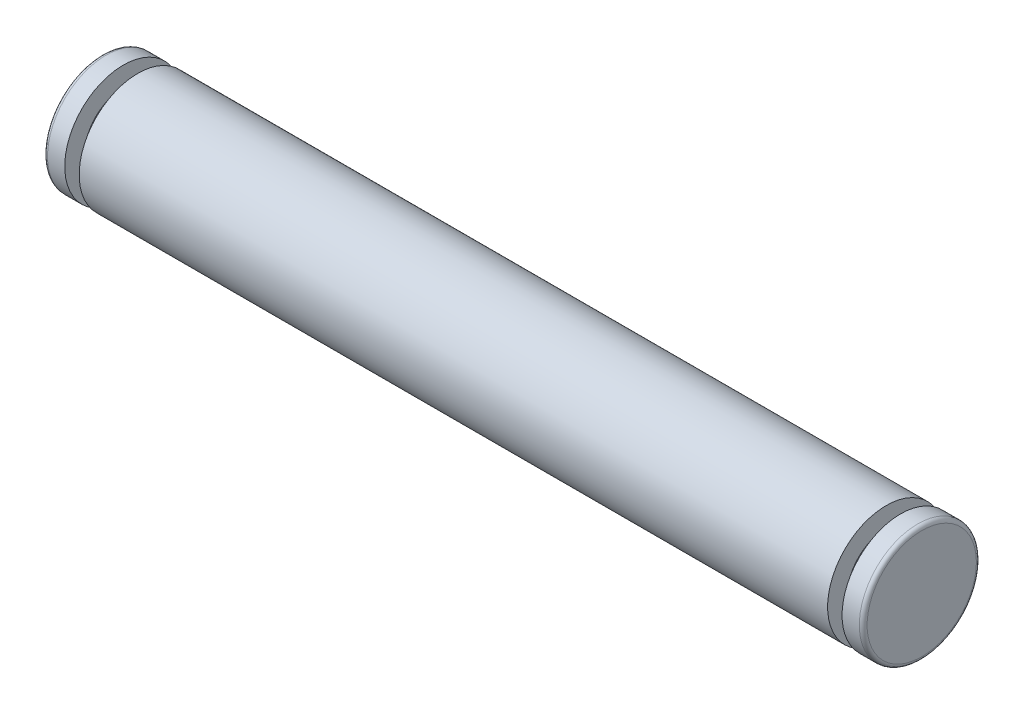
ISO-10303-21;
HEADER;
FILE_DESCRIPTION(('STEP AP214'),'2;1');
FILE_NAME('part.step','',(''),(''),'','','');
FILE_SCHEMA(('AUTOMOTIVE_DESIGN { 1 0 10303 214 1 1 1 1 }'));
ENDSEC;
DATA;
#1=APPLICATION_CONTEXT('core data for automotive mechanical design processes');
#2=APPLICATION_PROTOCOL_DEFINITION('international standard','automotive_design',2000,#1);
#3=PRODUCT_CONTEXT('',#1,'mechanical');
#4=PRODUCT('Part','Part','',(#3));
#5=PRODUCT_RELATED_PRODUCT_CATEGORY('part','',(#4));
#6=PRODUCT_DEFINITION_FORMATION('','',#4);
#7=PRODUCT_DEFINITION_CONTEXT('part definition',#1,'design');
#8=PRODUCT_DEFINITION('design','',#6,#7);
#9=PRODUCT_DEFINITION_SHAPE('','',#8);
#10=(LENGTH_UNIT() NAMED_UNIT(*) SI_UNIT(.MILLI.,.METRE.));
#11=(NAMED_UNIT(*) PLANE_ANGLE_UNIT() SI_UNIT($,.RADIAN.));
#12=(NAMED_UNIT(*) SI_UNIT($,.STERADIAN.) SOLID_ANGLE_UNIT());
#13=UNCERTAINTY_MEASURE_WITH_UNIT(LENGTH_MEASURE(1.E-05),#10,'distance_accuracy_value','');
#14=(GEOMETRIC_REPRESENTATION_CONTEXT(3) GLOBAL_UNCERTAINTY_ASSIGNED_CONTEXT((#13)) GLOBAL_UNIT_ASSIGNED_CONTEXT((#10,
#11,#12)) REPRESENTATION_CONTEXT('',''));
#15=CARTESIAN_POINT('',(0.,0.,0.));
#16=DIRECTION('',(0.,0.,1.));
#17=DIRECTION('',(1.,0.,0.));
#18=AXIS2_PLACEMENT_3D('',#15,#16,#17);
#19=CARTESIAN_POINT('',(-21.,0.,-2.8));
#20=DIRECTION('',(-1.,0.,0.));
#21=DIRECTION('',(0.,0.,1.));
#22=AXIS2_PLACEMENT_3D('',#19,#20,#21);
#23=PLANE('',#22);
#24=CARTESIAN_POINT('',(-21.,0.,0.));
#25=DIRECTION('',(1.,0.,0.));
#26=DIRECTION('',(0.,0.,-1.));
#27=AXIS2_PLACEMENT_3D('',#24,#25,#26);
#28=CIRCLE('',#27,2.8);
#29=CARTESIAN_POINT('',(-21.,0.,-2.8));
#30=VERTEX_POINT('',#29);
#31=EDGE_CURVE('E10',#30,#30,#28,.T.);
#32=ORIENTED_EDGE('',*,*,#31,.F.);
#33=EDGE_LOOP('',(#32));
#34=FACE_BOUND('',#33,.T.);
#35=ADVANCED_FACE('F37',(#34),#23,.T.);
#36=CARTESIAN_POINT('',(-20.8,0.,0.));
#37=DIRECTION('',(1.,0.,0.));
#38=DIRECTION('',(0.,0.,-1.));
#39=AXIS2_PLACEMENT_3D('',#36,#37,#38);
#40=TOROIDAL_SURFACE('',#39,2.8,0.2);
#41=ORIENTED_EDGE('',*,*,#31,.T.);
#42=EDGE_LOOP('',(#41));
#43=FACE_BOUND('',#42,.T.);
#44=CARTESIAN_POINT('',(-20.8,0.,0.));
#45=DIRECTION('',(1.,0.,0.));
#46=DIRECTION('',(0.,0.,-1.));
#47=AXIS2_PLACEMENT_3D('',#44,#45,#46);
#48=CIRCLE('',#47,3.);
#49=CARTESIAN_POINT('',(-20.8,0.,-3.));
#50=VERTEX_POINT('',#49);
#51=EDGE_CURVE('E44',#50,#50,#48,.T.);
#52=ORIENTED_EDGE('',*,*,#51,.F.);
#53=EDGE_LOOP('',(#52));
#54=FACE_BOUND('',#53,.T.);
#55=ADVANCED_FACE('F109',(#43,#54),#40,.T.);
#56=CARTESIAN_POINT('',(21.,0.,0.));
#57=DIRECTION('',(1.,0.,0.));
#58=DIRECTION('',(0.,0.,-1.));
#59=AXIS2_PLACEMENT_3D('',#56,#57,#58);
#60=CYLINDRICAL_SURFACE('',#59,3.);
#61=ORIENTED_EDGE('',*,*,#51,.T.);
#62=EDGE_LOOP('',(#61));
#63=FACE_BOUND('',#62,.T.);
#64=CARTESIAN_POINT('',(-19.917,0.,0.));
#65=DIRECTION('',(1.,0.,0.));
#66=DIRECTION('',(0.,0.,-1.));
#67=AXIS2_PLACEMENT_3D('',#64,#65,#66);
#68=CIRCLE('',#67,3.);
#69=CARTESIAN_POINT('',(-19.917,0.,-3.));
#70=VERTEX_POINT('',#69);
#71=EDGE_CURVE('E49',#70,#70,#68,.T.);
#72=ORIENTED_EDGE('',*,*,#71,.F.);
#73=EDGE_LOOP('',(#72));
#74=FACE_BOUND('',#73,.T.);
#75=ADVANCED_FACE('F114',(#63,#74),#60,.T.);
#76=CARTESIAN_POINT('',(-19.917,0.,-2.));
#77=DIRECTION('',(1.,0.,0.));
#78=DIRECTION('',(0.,0.,-1.));
#79=AXIS2_PLACEMENT_3D('',#76,#77,#78);
#80=PLANE('',#79);
#81=ORIENTED_EDGE('',*,*,#71,.T.);
#82=EDGE_LOOP('',(#81));
#83=FACE_BOUND('',#82,.T.);
#84=CARTESIAN_POINT('',(-19.917,0.,0.));
#85=DIRECTION('',(1.,0.,0.));
#86=DIRECTION('',(0.,0.,-1.));
#87=AXIS2_PLACEMENT_3D('',#84,#85,#86);
#88=CIRCLE('',#87,2.);
#89=CARTESIAN_POINT('',(-19.917,0.,-2.));
#90=VERTEX_POINT('',#89);
#91=EDGE_CURVE('E54',#90,#90,#88,.T.);
#92=ORIENTED_EDGE('',*,*,#91,.F.);
#93=EDGE_LOOP('',(#92));
#94=FACE_BOUND('',#93,.T.);
#95=ADVANCED_FACE('F118',(#83,#94),#80,.T.);
#96=CARTESIAN_POINT('',(21.,0.,0.));
#97=DIRECTION('',(1.,0.,0.));
#98=DIRECTION('',(0.,0.,-1.));
#99=AXIS2_PLACEMENT_3D('',#96,#97,#98);
#100=CYLINDRICAL_SURFACE('',#99,2.);
#101=ORIENTED_EDGE('',*,*,#91,.T.);
#102=EDGE_LOOP('',(#101));
#103=FACE_BOUND('',#102,.T.);
#104=CARTESIAN_POINT('',(-19.177,0.,0.));
#105=DIRECTION('',(1.,0.,0.));
#106=DIRECTION('',(0.,0.,-1.));
#107=AXIS2_PLACEMENT_3D('',#104,#105,#106);
#108=CIRCLE('',#107,2.);
#109=CARTESIAN_POINT('',(-19.177,0.,-2.));
#110=VERTEX_POINT('',#109);
#111=EDGE_CURVE('E60',#110,#110,#108,.T.);
#112=ORIENTED_EDGE('',*,*,#111,.F.);
#113=EDGE_LOOP('',(#112));
#114=FACE_BOUND('',#113,.T.);
#115=ADVANCED_FACE('F124',(#103,#114),#100,.T.);
#116=CARTESIAN_POINT('',(-19.177,0.,-3.));
#117=DIRECTION('',(-1.,0.,0.));
#118=DIRECTION('',(0.,0.,1.));
#119=AXIS2_PLACEMENT_3D('',#116,#117,#118);
#120=PLANE('',#119);
#121=ORIENTED_EDGE('',*,*,#111,.T.);
#122=EDGE_LOOP('',(#121));
#123=FACE_BOUND('',#122,.T.);
#124=CARTESIAN_POINT('',(-19.177,0.,0.));
#125=DIRECTION('',(1.,0.,0.));
#126=DIRECTION('',(0.,0.,-1.));
#127=AXIS2_PLACEMENT_3D('',#124,#125,#126);
#128=CIRCLE('',#127,3.);
#129=CARTESIAN_POINT('',(-19.177,0.,-3.));
#130=VERTEX_POINT('',#129);
#131=EDGE_CURVE('E64',#130,#130,#128,.T.);
#132=ORIENTED_EDGE('',*,*,#131,.F.);
#133=EDGE_LOOP('',(#132));
#134=FACE_BOUND('',#133,.T.);
#135=ADVANCED_FACE('F128',(#123,#134),#120,.T.);
#136=CARTESIAN_POINT('',(21.,0.,0.));
#137=DIRECTION('',(1.,0.,0.));
#138=DIRECTION('',(0.,0.,-1.));
#139=AXIS2_PLACEMENT_3D('',#136,#137,#138);
#140=CYLINDRICAL_SURFACE('',#139,3.);
#141=ORIENTED_EDGE('',*,*,#131,.T.);
#142=EDGE_LOOP('',(#141));
#143=FACE_BOUND('',#142,.T.);
#144=CARTESIAN_POINT('',(19.177,0.,0.));
#145=DIRECTION('',(1.,0.,0.));
#146=DIRECTION('',(0.,0.,-1.));
#147=AXIS2_PLACEMENT_3D('',#144,#145,#146);
#148=CIRCLE('',#147,3.);
#149=CARTESIAN_POINT('',(19.177,0.,-3.));
#150=VERTEX_POINT('',#149);
#151=EDGE_CURVE('E68',#150,#150,#148,.T.);
#152=ORIENTED_EDGE('',*,*,#151,.F.);
#153=EDGE_LOOP('',(#152));
#154=FACE_BOUND('',#153,.T.);
#155=ADVANCED_FACE('F132',(#143,#154),#140,.T.);
#156=CARTESIAN_POINT('',(19.177,0.,-3.));
#157=DIRECTION('',(1.,0.,0.));
#158=DIRECTION('',(0.,0.,-1.));
#159=AXIS2_PLACEMENT_3D('',#156,#157,#158);
#160=PLANE('',#159);
#161=ORIENTED_EDGE('',*,*,#151,.T.);
#162=EDGE_LOOP('',(#161));
#163=FACE_BOUND('',#162,.T.);
#164=CARTESIAN_POINT('',(19.177,0.,0.));
#165=DIRECTION('',(1.,0.,0.));
#166=DIRECTION('',(0.,0.,-1.));
#167=AXIS2_PLACEMENT_3D('',#164,#165,#166);
#168=CIRCLE('',#167,2.);
#169=CARTESIAN_POINT('',(19.177,0.,-2.));
#170=VERTEX_POINT('',#169);
#171=EDGE_CURVE('E72',#170,#170,#168,.T.);
#172=ORIENTED_EDGE('',*,*,#171,.F.);
#173=EDGE_LOOP('',(#172));
#174=FACE_BOUND('',#173,.T.);
#175=ADVANCED_FACE('F136',(#163,#174),#160,.T.);
#176=CARTESIAN_POINT('',(21.,0.,0.));
#177=DIRECTION('',(1.,0.,0.));
#178=DIRECTION('',(0.,0.,-1.));
#179=AXIS2_PLACEMENT_3D('',#176,#177,#178);
#180=CYLINDRICAL_SURFACE('',#179,2.);
#181=ORIENTED_EDGE('',*,*,#171,.T.);
#182=EDGE_LOOP('',(#181));
#183=FACE_BOUND('',#182,.T.);
#184=CARTESIAN_POINT('',(19.917,0.,0.));
#185=DIRECTION('',(1.,0.,0.));
#186=DIRECTION('',(0.,0.,-1.));
#187=AXIS2_PLACEMENT_3D('',#184,#185,#186);
#188=CIRCLE('',#187,2.);
#189=CARTESIAN_POINT('',(19.917,0.,-2.));
#190=VERTEX_POINT('',#189);
#191=EDGE_CURVE('E76',#190,#190,#188,.T.);
#192=ORIENTED_EDGE('',*,*,#191,.F.);
#193=EDGE_LOOP('',(#192));
#194=FACE_BOUND('',#193,.T.);
#195=ADVANCED_FACE('F140',(#183,#194),#180,.T.);
#196=CARTESIAN_POINT('',(19.917,0.,-2.));
#197=DIRECTION('',(-1.,0.,0.));
#198=DIRECTION('',(0.,0.,1.));
#199=AXIS2_PLACEMENT_3D('',#196,#197,#198);
#200=PLANE('',#199);
#201=ORIENTED_EDGE('',*,*,#191,.T.);
#202=EDGE_LOOP('',(#201));
#203=FACE_BOUND('',#202,.T.);
#204=CARTESIAN_POINT('',(19.917,0.,0.));
#205=DIRECTION('',(1.,0.,0.));
#206=DIRECTION('',(0.,0.,-1.));
#207=AXIS2_PLACEMENT_3D('',#204,#205,#206);
#208=CIRCLE('',#207,3.);
#209=CARTESIAN_POINT('',(19.917,0.,-3.));
#210=VERTEX_POINT('',#209);
#211=EDGE_CURVE('E80',#210,#210,#208,.T.);
#212=ORIENTED_EDGE('',*,*,#211,.F.);
#213=EDGE_LOOP('',(#212));
#214=FACE_BOUND('',#213,.T.);
#215=ADVANCED_FACE('F105',(#203,#214),#200,.T.);
#216=CARTESIAN_POINT('',(21.,0.,0.));
#217=DIRECTION('',(1.,0.,0.));
#218=DIRECTION('',(0.,0.,-1.));
#219=AXIS2_PLACEMENT_3D('',#216,#217,#218);
#220=CYLINDRICAL_SURFACE('',#219,3.);
#221=ORIENTED_EDGE('',*,*,#211,.T.);
#222=EDGE_LOOP('',(#221));
#223=FACE_BOUND('',#222,.T.);
#224=CARTESIAN_POINT('',(20.8,0.,0.));
#225=DIRECTION('',(1.,0.,0.));
#226=DIRECTION('',(0.,0.,-1.));
#227=AXIS2_PLACEMENT_3D('',#224,#225,#226);
#228=CIRCLE('',#227,3.);
#229=CARTESIAN_POINT('',(20.8,0.,-3.));
#230=VERTEX_POINT('',#229);
#231=EDGE_CURVE('E84',#230,#230,#228,.T.);
#232=ORIENTED_EDGE('',*,*,#231,.F.);
#233=EDGE_LOOP('',(#232));
#234=FACE_BOUND('',#233,.T.);
#235=ADVANCED_FACE('F97',(#223,#234),#220,.T.);
#236=CARTESIAN_POINT('',(20.8,0.,0.));
#237=DIRECTION('',(1.,0.,0.));
#238=DIRECTION('',(0.,0.,-1.));
#239=AXIS2_PLACEMENT_3D('',#236,#237,#238);
#240=TOROIDAL_SURFACE('',#239,2.8,0.2);
#241=ORIENTED_EDGE('',*,*,#231,.T.);
#242=EDGE_LOOP('',(#241));
#243=FACE_BOUND('',#242,.T.);
#244=CARTESIAN_POINT('',(21.,0.,0.));
#245=DIRECTION('',(1.,0.,0.));
#246=DIRECTION('',(0.,0.,-1.));
#247=AXIS2_PLACEMENT_3D('',#244,#245,#246);
#248=CIRCLE('',#247,2.8);
#249=CARTESIAN_POINT('',(21.,0.,-2.8));
#250=VERTEX_POINT('',#249);
#251=EDGE_CURVE('E88',#250,#250,#248,.T.);
#252=ORIENTED_EDGE('',*,*,#251,.F.);
#253=EDGE_LOOP('',(#252));
#254=FACE_BOUND('',#253,.T.);
#255=ADVANCED_FACE('F95',(#243,#254),#240,.T.);
#256=CARTESIAN_POINT('',(21.,0.,-2.8));
#257=DIRECTION('',(1.,0.,0.));
#258=DIRECTION('',(0.,0.,-1.));
#259=AXIS2_PLACEMENT_3D('',#256,#257,#258);
#260=PLANE('',#259);
#261=ORIENTED_EDGE('',*,*,#251,.T.);
#262=EDGE_LOOP('',(#261));
#263=FACE_BOUND('',#262,.T.);
#264=ADVANCED_FACE('F93',(#263),#260,.T.);
#265=CLOSED_SHELL('',(#35,#55,#75,#95,#115,#135,#155,#175,#195,#215,#235,#255,#264));
#266=MANIFOLD_SOLID_BREP('B2',#265);
#267=ADVANCED_BREP_SHAPE_REPRESENTATION('',(#18,#266),#14);
#268=SHAPE_DEFINITION_REPRESENTATION(#9,#267);
ENDSEC;
END-ISO-10303-21;
